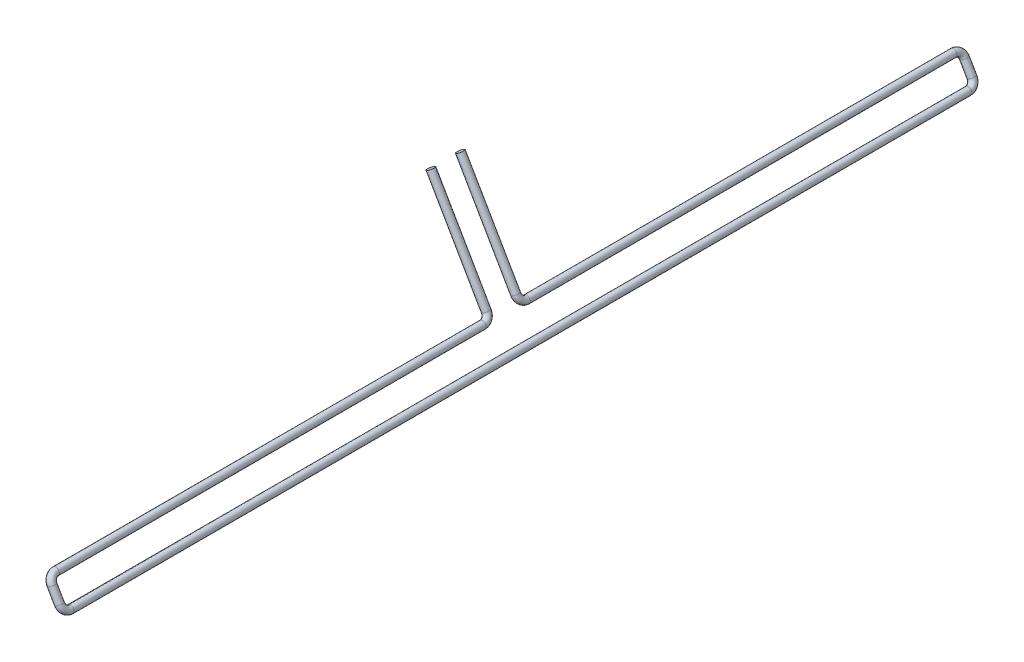
ISO-10303-21;
HEADER;
FILE_DESCRIPTION(('STEP AP214'),'2;1');
FILE_NAME('part.step','',(''),(''),'','','');
FILE_SCHEMA(('AUTOMOTIVE_DESIGN { 1 0 10303 214 1 1 1 1 }'));
ENDSEC;
DATA;
#1=APPLICATION_CONTEXT('core data for automotive mechanical design processes');
#2=APPLICATION_PROTOCOL_DEFINITION('international standard','automotive_design',2000,#1);
#3=PRODUCT_CONTEXT('',#1,'mechanical');
#4=PRODUCT('Part','Part','',(#3));
#5=PRODUCT_RELATED_PRODUCT_CATEGORY('part','',(#4));
#6=PRODUCT_DEFINITION_FORMATION('','',#4);
#7=PRODUCT_DEFINITION_CONTEXT('part definition',#1,'design');
#8=PRODUCT_DEFINITION('design','',#6,#7);
#9=PRODUCT_DEFINITION_SHAPE('','',#8);
#10=(LENGTH_UNIT() NAMED_UNIT(*) SI_UNIT(.MILLI.,.METRE.));
#11=(NAMED_UNIT(*) PLANE_ANGLE_UNIT() SI_UNIT($,.RADIAN.));
#12=(NAMED_UNIT(*) SI_UNIT($,.STERADIAN.) SOLID_ANGLE_UNIT());
#13=UNCERTAINTY_MEASURE_WITH_UNIT(LENGTH_MEASURE(1.E-05),#10,'distance_accuracy_value','');
#14=(GEOMETRIC_REPRESENTATION_CONTEXT(3) GLOBAL_UNCERTAINTY_ASSIGNED_CONTEXT((#13)) GLOBAL_UNIT_ASSIGNED_CONTEXT((#10,
#11,#12)) REPRESENTATION_CONTEXT('',''));
#15=CARTESIAN_POINT('',(0.,0.,0.));
#16=DIRECTION('',(0.,0.,1.));
#17=DIRECTION('',(1.,0.,0.));
#18=AXIS2_PLACEMENT_3D('',#15,#16,#17);
#19=CARTESIAN_POINT('',(16.4992889944565,29.2140444188278,3.));
#20=DIRECTION('',(-0.5,0.866025403784438,0.));
#21=DIRECTION('',(0.75,0.43301270189222,0.500000000000001));
#22=AXIS2_PLACEMENT_3D('',#19,#20,#21);
#23=PLANE('',#22);
#24=CARTESIAN_POINT('',(16.4992889944565,29.2140444188278,3.));
#25=DIRECTION('',(-0.5,0.866025403784438,0.));
#26=DIRECTION('',(0.75,0.43301270189222,0.500000000000001));
#27=AXIS2_PLACEMENT_3D('',#24,#25,#26);
#28=CIRCLE('',#27,0.749999999999999);
#29=CARTESIAN_POINT('',(17.0617889944565,29.5388039452469,3.375));
#30=VERTEX_POINT('',#29);
#31=EDGE_CURVE('E11',#30,#30,#28,.T.);
#32=ORIENTED_EDGE('',*,*,#31,.T.);
#33=EDGE_LOOP('',(#32));
#34=FACE_BOUND('',#33,.T.);
#35=ADVANCED_FACE('F32',(#34),#23,.T.);
#36=CARTESIAN_POINT('',(31.537058846496,3.167863002568,0.));
#37=DIRECTION('',(0.,0.,1.));
#38=DIRECTION('',(0.,-1.,0.));
#39=AXIS2_PLACEMENT_3D('',#36,#37,#38);
#40=CYLINDRICAL_SURFACE('',#39,0.749999999999999);
#41=CARTESIAN_POINT('',(31.537058846496,3.167863002568,91.52));
#42=DIRECTION('',(0.,0.,1.));
#43=DIRECTION('',(1.,0.,0.));
#44=AXIS2_PLACEMENT_3D('',#41,#42,#43);
#45=CIRCLE('',#44,0.749999999999999);
#46=CARTESIAN_POINT('',(31.912058846496,2.51834394972967,91.52));
#47=VERTEX_POINT('',#46);
#48=EDGE_CURVE('E49',#47,#47,#45,.T.);
#49=ORIENTED_EDGE('',*,*,#48,.F.);
#50=EDGE_LOOP('',(#49));
#51=FACE_BOUND('',#50,.T.);
#52=CARTESIAN_POINT('',(31.537058846496,3.167863002568,-91.52));
#53=DIRECTION('',(0.,0.,1.));
#54=DIRECTION('',(1.,0.,0.));
#55=AXIS2_PLACEMENT_3D('',#52,#53,#54);
#56=CIRCLE('',#55,0.749999999999999);
#57=CARTESIAN_POINT('',(31.912058846496,2.51834394972967,-91.52));
#58=VERTEX_POINT('',#57);
#59=EDGE_CURVE('E111',#58,#58,#56,.F.);
#60=ORIENTED_EDGE('',*,*,#59,.F.);
#61=EDGE_LOOP('',(#60));
#62=FACE_BOUND('',#61,.T.);
#63=ADVANCED_FACE('F102',(#51,#62),#40,.T.);
#64=CARTESIAN_POINT('',(30.787058846496,4.46690110824466,91.52));
#65=DIRECTION('',(-0.866025403784438,-0.500000000000001,0.));
#66=DIRECTION('',(0.500000000000001,-0.866025403784438,0.));
#67=AXIS2_PLACEMENT_3D('',#64,#65,#66);
#68=TOROIDAL_SURFACE('',#67,1.5,0.749999999999999);
#69=CARTESIAN_POINT('',(30.787058846496,4.46690110824466,93.02));
#70=DIRECTION('',(-0.5,0.866025403784438,0.));
#71=DIRECTION('',(0.75,0.43301270189222,0.500000000000001));
#72=AXIS2_PLACEMENT_3D('',#69,#70,#71);
#73=CIRCLE('',#72,0.749999999999999);
#74=CARTESIAN_POINT('',(30.787058846496,4.46690110824466,93.77));
#75=VERTEX_POINT('',#74);
#76=EDGE_CURVE('E53',#75,#75,#73,.T.);
#77=CARTESIAN_POINT('',(30.787058846496,4.46690110824466,91.52));
#78=DIRECTION('',(-0.866025403784438,-0.500000000000001,0.));
#79=DIRECTION('',(0.500000000000001,-0.866025403784438,0.));
#80=AXIS2_PLACEMENT_3D('',#77,#78,#79);
#81=CIRCLE('',#80,2.25);
#82=EDGE_CURVE('',#47,#75,#81,.T.);
#83=ORIENTED_EDGE('',*,*,#48,.T.);
#84=ORIENTED_EDGE('',*,*,#76,.F.);
#85=ORIENTED_EDGE('',*,*,#82,.T.);
#86=ORIENTED_EDGE('',*,*,#82,.F.);
#87=EDGE_LOOP('',(#83,#85,#84,#86));
#88=FACE_BOUND('',#87,.T.);
#89=ADVANCED_FACE('F96',(#88),#68,.T.);
#90=CARTESIAN_POINT('',(30.787058846496,4.46690110824466,93.02));
#91=DIRECTION('',(-0.5,0.866025403784438,0.));
#92=DIRECTION('',(-0.866025403784438,-0.500000000000001,0.));
#93=AXIS2_PLACEMENT_3D('',#90,#91,#92);
#94=CYLINDRICAL_SURFACE('',#93,0.749999999999999);
#95=CARTESIAN_POINT('',(29.2833167233369,7.07145886703757,93.02));
#96=DIRECTION('',(-0.5,0.866025403784438,0.));
#97=DIRECTION('',(0.75,0.43301270189222,0.500000000000001));
#98=AXIS2_PLACEMENT_3D('',#95,#96,#97);
#99=CIRCLE('',#98,0.749999999999999);
#100=CARTESIAN_POINT('',(29.2833167233369,7.07145886703757,93.77));
#101=VERTEX_POINT('',#100);
#102=EDGE_CURVE('E62',#101,#101,#99,.T.);
#103=ORIENTED_EDGE('',*,*,#102,.F.);
#104=EDGE_LOOP('',(#103));
#105=FACE_BOUND('',#104,.T.);
#106=ORIENTED_EDGE('',*,*,#76,.T.);
#107=EDGE_LOOP('',(#106));
#108=FACE_BOUND('',#107,.T.);
#109=ADVANCED_FACE('F90',(#105,#108),#94,.T.);
#110=CARTESIAN_POINT('',(29.2833167233369,7.07145886703757,91.52));
#111=DIRECTION('',(-0.866025403784438,-0.500000000000001,0.));
#112=DIRECTION('',(0.500000000000001,-0.866025403784438,0.));
#113=AXIS2_PLACEMENT_3D('',#110,#111,#112);
#114=TOROIDAL_SURFACE('',#113,1.5,0.749999999999999);
#115=CARTESIAN_POINT('',(28.5333167233369,8.37049697271423,91.52));
#116=DIRECTION('',(0.,0.,-1.));
#117=DIRECTION('',(0.499999999999999,0.866025403784439,0.));
#118=AXIS2_PLACEMENT_3D('',#115,#116,#117);
#119=CIRCLE('',#118,0.749999999999999);
#120=CARTESIAN_POINT('',(28.1583167233369,9.02001602555256,91.52));
#121=VERTEX_POINT('',#120);
#122=EDGE_CURVE('E65',#121,#121,#119,.T.);
#123=CARTESIAN_POINT('',(29.2833167233369,7.07145886703757,91.52));
#124=DIRECTION('',(-0.866025403784438,-0.500000000000001,0.));
#125=DIRECTION('',(0.500000000000001,-0.866025403784438,0.));
#126=AXIS2_PLACEMENT_3D('',#123,#124,#125);
#127=CIRCLE('',#126,2.25);
#128=EDGE_CURVE('',#101,#121,#127,.T.);
#129=ORIENTED_EDGE('',*,*,#102,.T.);
#130=ORIENTED_EDGE('',*,*,#122,.F.);
#131=ORIENTED_EDGE('',*,*,#128,.T.);
#132=ORIENTED_EDGE('',*,*,#128,.F.);
#133=EDGE_LOOP('',(#129,#131,#130,#132));
#134=FACE_BOUND('',#133,.T.);
#135=ADVANCED_FACE('F84',(#134),#114,.T.);
#136=CARTESIAN_POINT('',(28.5333167233369,8.37049697271423,91.52));
#137=DIRECTION('',(0.,0.,-1.));
#138=DIRECTION('',(0.,1.,0.));
#139=AXIS2_PLACEMENT_3D('',#136,#137,#138);
#140=CYLINDRICAL_SURFACE('',#139,0.749999999999999);
#141=CARTESIAN_POINT('',(28.533316723337,8.37049697271421,4.5));
#142=DIRECTION('',(0.,0.,-1.));
#143=DIRECTION('',(0.499999999999999,0.866025403784439,0.));
#144=AXIS2_PLACEMENT_3D('',#141,#142,#143);
#145=CIRCLE('',#144,0.749999999999999);
#146=CARTESIAN_POINT('',(28.908316723337,7.72097791987588,4.5));
#147=VERTEX_POINT('',#146);
#148=EDGE_CURVE('E68',#147,#147,#145,.T.);
#149=ORIENTED_EDGE('',*,*,#148,.F.);
#150=EDGE_LOOP('',(#149));
#151=FACE_BOUND('',#150,.T.);
#152=ORIENTED_EDGE('',*,*,#122,.T.);
#153=EDGE_LOOP('',(#152));
#154=FACE_BOUND('',#153,.T.);
#155=ADVANCED_FACE('F78',(#151,#154),#140,.T.);
#156=CARTESIAN_POINT('',(27.7833167233369,9.66953507839087,4.5));
#157=DIRECTION('',(0.866025403784438,0.500000000000001,0.));
#158=DIRECTION('',(-0.500000000000001,0.866025403784438,0.));
#159=AXIS2_PLACEMENT_3D('',#156,#157,#158);
#160=TOROIDAL_SURFACE('',#159,1.5,0.749999999999999);
#161=CARTESIAN_POINT('',(27.7833167233369,9.66953507839086,3.));
#162=DIRECTION('',(-0.5,0.866025403784438,0.));
#163=DIRECTION('',(0.75,0.43301270189222,0.500000000000001));
#164=AXIS2_PLACEMENT_3D('',#161,#162,#163);
#165=CIRCLE('',#164,0.749999999999999);
#166=CARTESIAN_POINT('',(27.7833167233369,9.66953507839086,2.25));
#167=VERTEX_POINT('',#166);
#168=EDGE_CURVE('E39',#167,#167,#165,.T.);
#169=CARTESIAN_POINT('',(27.7833167233369,9.66953507839087,4.5));
#170=DIRECTION('',(0.866025403784438,0.500000000000001,0.));
#171=DIRECTION('',(-0.500000000000001,0.866025403784438,0.));
#172=AXIS2_PLACEMENT_3D('',#169,#170,#171);
#173=CIRCLE('',#172,2.25);
#174=EDGE_CURVE('',#147,#167,#173,.T.);
#175=ORIENTED_EDGE('',*,*,#148,.T.);
#176=ORIENTED_EDGE('',*,*,#168,.F.);
#177=ORIENTED_EDGE('',*,*,#174,.T.);
#178=ORIENTED_EDGE('',*,*,#174,.F.);
#179=EDGE_LOOP('',(#175,#177,#176,#178));
#180=FACE_BOUND('',#179,.T.);
#181=ADVANCED_FACE('F75',(#180),#160,.T.);
#182=CARTESIAN_POINT('',(27.7833167233369,9.66953507839087,3.));
#183=DIRECTION('',(-0.500000000000001,0.866025403784438,0.));
#184=DIRECTION('',(-0.866025403784438,-0.500000000000001,0.));
#185=AXIS2_PLACEMENT_3D('',#182,#183,#184);
#186=CYLINDRICAL_SURFACE('',#185,0.749999999999999);
#187=ORIENTED_EDGE('',*,*,#31,.F.);
#188=EDGE_LOOP('',(#187));
#189=FACE_BOUND('',#188,.T.);
#190=ORIENTED_EDGE('',*,*,#168,.T.);
#191=EDGE_LOOP('',(#190));
#192=FACE_BOUND('',#191,.T.);
#193=ADVANCED_FACE('F73',(#189,#192),#186,.T.);
#194=CARTESIAN_POINT('',(16.4992889944565,29.2140444188278,-3.));
#195=DIRECTION('',(-0.5,0.866025403784438,0.));
#196=DIRECTION('',(0.75,0.43301270189222,-0.500000000000001));
#197=AXIS2_PLACEMENT_3D('',#194,#195,#196);
#198=PLANE('',#197);
#199=CARTESIAN_POINT('',(16.4992889944565,29.2140444188278,-3.));
#200=DIRECTION('',(0.5,-0.866025403784438,0.));
#201=DIRECTION('',(0.75,0.43301270189222,-0.500000000000001));
#202=AXIS2_PLACEMENT_3D('',#199,#200,#201);
#203=CIRCLE('',#202,0.749999999999999);
#204=CARTESIAN_POINT('',(17.0617889944565,29.5388039452469,-3.375));
#205=VERTEX_POINT('',#204);
#206=EDGE_CURVE('E46',#205,#205,#203,.F.);
#207=ORIENTED_EDGE('',*,*,#206,.T.);
#208=EDGE_LOOP('',(#207));
#209=FACE_BOUND('',#208,.T.);
#210=ADVANCED_FACE('F47',(#209),#198,.T.);
#211=CARTESIAN_POINT('',(30.787058846496,4.46690110824466,-91.52));
#212=DIRECTION('',(0.866025403784438,0.500000000000001,0.));
#213=DIRECTION('',(-0.500000000000001,0.866025403784438,0.));
#214=AXIS2_PLACEMENT_3D('',#211,#212,#213);
#215=TOROIDAL_SURFACE('',#214,1.5,0.749999999999999);
#216=CARTESIAN_POINT('',(30.787058846496,4.46690110824466,-93.02));
#217=DIRECTION('',(0.5,-0.866025403784438,0.));
#218=DIRECTION('',(0.75,0.43301270189222,-0.500000000000001));
#219=AXIS2_PLACEMENT_3D('',#216,#217,#218);
#220=CIRCLE('',#219,0.749999999999999);
#221=CARTESIAN_POINT('',(30.787058846496,4.46690110824466,-93.77));
#222=VERTEX_POINT('',#221);
#223=EDGE_CURVE('E113',#222,#222,#220,.F.);
#224=CARTESIAN_POINT('',(30.787058846496,4.46690110824466,-91.52));
#225=DIRECTION('',(0.866025403784438,0.500000000000001,0.));
#226=DIRECTION('',(-0.500000000000001,0.866025403784438,0.));
#227=AXIS2_PLACEMENT_3D('',#224,#225,#226);
#228=CIRCLE('',#227,2.25);
#229=EDGE_CURVE('',#58,#222,#228,.T.);
#230=ORIENTED_EDGE('',*,*,#59,.T.);
#231=ORIENTED_EDGE('',*,*,#223,.F.);
#232=ORIENTED_EDGE('',*,*,#229,.T.);
#233=ORIENTED_EDGE('',*,*,#229,.F.);
#234=EDGE_LOOP('',(#230,#232,#231,#233));
#235=FACE_BOUND('',#234,.T.);
#236=ADVANCED_FACE('F143',(#235),#215,.T.);
#237=CARTESIAN_POINT('',(30.787058846496,4.46690110824466,-93.02));
#238=DIRECTION('',(-0.5,0.866025403784438,0.));
#239=DIRECTION('',(-0.866025403784438,-0.500000000000001,0.));
#240=AXIS2_PLACEMENT_3D('',#237,#238,#239);
#241=CYLINDRICAL_SURFACE('',#240,0.749999999999999);
#242=CARTESIAN_POINT('',(29.2833167233369,7.07145886703757,-93.02));
#243=DIRECTION('',(0.5,-0.866025403784438,0.));
#244=DIRECTION('',(0.75,0.43301270189222,-0.500000000000001));
#245=AXIS2_PLACEMENT_3D('',#242,#243,#244);
#246=CIRCLE('',#245,0.749999999999999);
#247=CARTESIAN_POINT('',(29.2833167233369,7.07145886703757,-93.77));
#248=VERTEX_POINT('',#247);
#249=EDGE_CURVE('E116',#248,#248,#246,.F.);
#250=ORIENTED_EDGE('',*,*,#249,.F.);
#251=EDGE_LOOP('',(#250));
#252=FACE_BOUND('',#251,.T.);
#253=ORIENTED_EDGE('',*,*,#223,.T.);
#254=EDGE_LOOP('',(#253));
#255=FACE_BOUND('',#254,.T.);
#256=ADVANCED_FACE('F137',(#252,#255),#241,.T.);
#257=CARTESIAN_POINT('',(29.2833167233369,7.07145886703757,-91.52));
#258=DIRECTION('',(0.866025403784438,0.500000000000001,0.));
#259=DIRECTION('',(-0.500000000000001,0.866025403784438,0.));
#260=AXIS2_PLACEMENT_3D('',#257,#258,#259);
#261=TOROIDAL_SURFACE('',#260,1.5,0.749999999999999);
#262=CARTESIAN_POINT('',(28.5333167233369,8.37049697271423,-91.52));
#263=DIRECTION('',(0.,0.,-1.));
#264=DIRECTION('',(0.499999999999999,0.866025403784439,0.));
#265=AXIS2_PLACEMENT_3D('',#262,#263,#264);
#266=CIRCLE('',#265,0.749999999999999);
#267=CARTESIAN_POINT('',(28.1583167233369,9.02001602555256,-91.52));
#268=VERTEX_POINT('',#267);
#269=EDGE_CURVE('E121',#268,#268,#266,.F.);
#270=CARTESIAN_POINT('',(29.2833167233369,7.07145886703757,-91.52));
#271=DIRECTION('',(0.866025403784438,0.500000000000001,0.));
#272=DIRECTION('',(-0.500000000000001,0.866025403784438,0.));
#273=AXIS2_PLACEMENT_3D('',#270,#271,#272);
#274=CIRCLE('',#273,2.25);
#275=EDGE_CURVE('',#248,#268,#274,.T.);
#276=ORIENTED_EDGE('',*,*,#249,.T.);
#277=ORIENTED_EDGE('',*,*,#269,.F.);
#278=ORIENTED_EDGE('',*,*,#275,.T.);
#279=ORIENTED_EDGE('',*,*,#275,.F.);
#280=EDGE_LOOP('',(#276,#278,#277,#279));
#281=FACE_BOUND('',#280,.T.);
#282=ADVANCED_FACE('F131',(#281),#261,.T.);
#283=CARTESIAN_POINT('',(28.5333167233369,8.37049697271423,-91.52));
#284=DIRECTION('',(0.,0.,1.));
#285=DIRECTION('',(0.,-1.,0.));
#286=AXIS2_PLACEMENT_3D('',#283,#284,#285);
#287=CYLINDRICAL_SURFACE('',#286,0.749999999999999);
#288=CARTESIAN_POINT('',(28.533316723337,8.37049697271421,-4.5));
#289=DIRECTION('',(0.,0.,-1.));
#290=DIRECTION('',(0.499999999999999,0.866025403784439,0.));
#291=AXIS2_PLACEMENT_3D('',#288,#289,#290);
#292=CIRCLE('',#291,0.749999999999999);
#293=CARTESIAN_POINT('',(28.908316723337,7.72097791987588,-4.5));
#294=VERTEX_POINT('',#293);
#295=EDGE_CURVE('E56',#294,#294,#292,.F.);
#296=ORIENTED_EDGE('',*,*,#295,.F.);
#297=EDGE_LOOP('',(#296));
#298=FACE_BOUND('',#297,.T.);
#299=ORIENTED_EDGE('',*,*,#269,.T.);
#300=EDGE_LOOP('',(#299));
#301=FACE_BOUND('',#300,.T.);
#302=ADVANCED_FACE('F128',(#298,#301),#287,.T.);
#303=CARTESIAN_POINT('',(27.7833167233369,9.66953507839087,-4.5));
#304=DIRECTION('',(-0.866025403784438,-0.500000000000001,0.));
#305=DIRECTION('',(0.500000000000001,-0.866025403784438,0.));
#306=AXIS2_PLACEMENT_3D('',#303,#304,#305);
#307=TOROIDAL_SURFACE('',#306,1.5,0.749999999999999);
#308=CARTESIAN_POINT('',(27.7833167233369,9.66953507839086,-3.));
#309=DIRECTION('',(0.5,-0.866025403784438,0.));
#310=DIRECTION('',(0.75,0.43301270189222,-0.500000000000001));
#311=AXIS2_PLACEMENT_3D('',#308,#309,#310);
#312=CIRCLE('',#311,0.749999999999999);
#313=CARTESIAN_POINT('',(27.7833167233369,9.66953507839086,-2.25));
#314=VERTEX_POINT('',#313);
#315=EDGE_CURVE('E50',#314,#314,#312,.F.);
#316=CARTESIAN_POINT('',(27.7833167233369,9.66953507839087,-4.5));
#317=DIRECTION('',(-0.866025403784438,-0.500000000000001,0.));
#318=DIRECTION('',(0.500000000000001,-0.866025403784438,0.));
#319=AXIS2_PLACEMENT_3D('',#316,#317,#318);
#320=CIRCLE('',#319,2.25);
#321=EDGE_CURVE('',#294,#314,#320,.T.);
#322=ORIENTED_EDGE('',*,*,#295,.T.);
#323=ORIENTED_EDGE('',*,*,#315,.F.);
#324=ORIENTED_EDGE('',*,*,#321,.T.);
#325=ORIENTED_EDGE('',*,*,#321,.F.);
#326=EDGE_LOOP('',(#322,#324,#323,#325));
#327=FACE_BOUND('',#326,.T.);
#328=ADVANCED_FACE('F126',(#327),#307,.T.);
#329=CARTESIAN_POINT('',(27.7833167233369,9.66953507839087,-3.));
#330=DIRECTION('',(-0.500000000000001,0.866025403784438,0.));
#331=DIRECTION('',(-0.866025403784438,-0.500000000000001,0.));
#332=AXIS2_PLACEMENT_3D('',#329,#330,#331);
#333=CYLINDRICAL_SURFACE('',#332,0.749999999999999);
#334=ORIENTED_EDGE('',*,*,#206,.F.);
#335=EDGE_LOOP('',(#334));
#336=FACE_BOUND('',#335,.T.);
#337=ORIENTED_EDGE('',*,*,#315,.T.);
#338=EDGE_LOOP('',(#337));
#339=FACE_BOUND('',#338,.T.);
#340=ADVANCED_FACE('F158',(#336,#339),#333,.T.);
#341=CLOSED_SHELL('',(#35,#63,#89,#109,#135,#155,#181,#193,#210,#236,#256,#282,#302,#328,#340));
#342=MANIFOLD_SOLID_BREP('B2',#341);
#343=ADVANCED_BREP_SHAPE_REPRESENTATION('',(#18,#342),#14);
#344=SHAPE_DEFINITION_REPRESENTATION(#9,#343);
ENDSEC;
END-ISO-10303-21;
